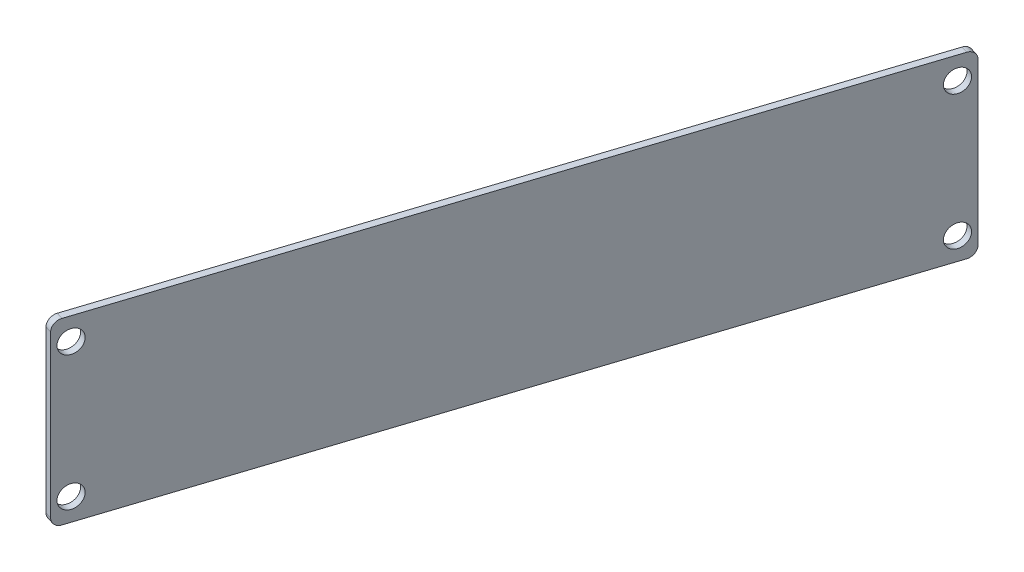
ISO-10303-21;
HEADER;
FILE_DESCRIPTION(('STEP AP214'),'2;1');
FILE_NAME('part.step','',(''),(''),'','','');
FILE_SCHEMA(('AUTOMOTIVE_DESIGN { 1 0 10303 214 1 1 1 1 }'));
ENDSEC;
DATA;
#1=APPLICATION_CONTEXT('core data for automotive mechanical design processes');
#2=APPLICATION_PROTOCOL_DEFINITION('international standard','automotive_design',2000,#1);
#3=PRODUCT_CONTEXT('',#1,'mechanical');
#4=PRODUCT('Part','Part','',(#3));
#5=PRODUCT_RELATED_PRODUCT_CATEGORY('part','',(#4));
#6=PRODUCT_DEFINITION_FORMATION('','',#4);
#7=PRODUCT_DEFINITION_CONTEXT('part definition',#1,'design');
#8=PRODUCT_DEFINITION('design','',#6,#7);
#9=PRODUCT_DEFINITION_SHAPE('','',#8);
#10=(LENGTH_UNIT() NAMED_UNIT(*) SI_UNIT(.MILLI.,.METRE.));
#11=(NAMED_UNIT(*) PLANE_ANGLE_UNIT() SI_UNIT($,.RADIAN.));
#12=(NAMED_UNIT(*) SI_UNIT($,.STERADIAN.) SOLID_ANGLE_UNIT());
#13=UNCERTAINTY_MEASURE_WITH_UNIT(LENGTH_MEASURE(1.E-05),#10,'distance_accuracy_value','');
#14=(GEOMETRIC_REPRESENTATION_CONTEXT(3) GLOBAL_UNCERTAINTY_ASSIGNED_CONTEXT((#13)) GLOBAL_UNIT_ASSIGNED_CONTEXT((#10,
#11,#12)) REPRESENTATION_CONTEXT('',''));
#15=CARTESIAN_POINT('',(0.,0.,0.));
#16=DIRECTION('',(0.,0.,1.));
#17=DIRECTION('',(1.,0.,0.));
#18=AXIS2_PLACEMENT_3D('',#15,#16,#17);
#19=CARTESIAN_POINT('',(-6.99958640490557,-1.43554837217458E-12,95.7236856182648));
#20=DIRECTION('',(0.,-1.,0.));
#21=DIRECTION('',(-0.309016994374967,0.,0.951056516295147));
#22=AXIS2_PLACEMENT_3D('',#19,#20,#21);
#23=PLANE('',#22);
#24=DIRECTION('',(-0.309016994374967,0.,0.951056516295147));
#25=VECTOR('',#24,1.);
#26=CARTESIAN_POINT('',(-6.99958640490557,-1.43554837217458E-12,95.7236856182648));
#27=LINE('',#26,#25);
#28=CARTESIAN_POINT('',(25.5307854164267,0.,-4.3945041944349));
#29=VERTEX_POINT('',#28);
#30=CARTESIAN_POINT('',(-24.0791085074902,-2.62772524152783E-12,148.289049616207));
#31=VERTEX_POINT('',#30);
#32=EDGE_CURVE('E107',#29,#31,#27,.T.);
#33=ORIENTED_EDGE('',*,*,#32,.F.);
#34=DIRECTION('',(-0.951056516295146,0.,-0.309016994374971));
#35=VECTOR('',#34,1.);
#36=CARTESIAN_POINT('',(27.0524758424989,0.,-3.90007700343494));
#37=LINE('',#36,#35);
#38=CARTESIAN_POINT('',(27.0524758424989,0.,-3.90007700343495));
#39=VERTEX_POINT('',#38);
#40=EDGE_CURVE('E203',#29,#39,#37,.F.);
#41=ORIENTED_EDGE('',*,*,#40,.T.);
#42=DIRECTION('',(-0.309016994374965,0.,0.951056516295147));
#43=VECTOR('',#42,1.);
#44=CARTESIAN_POINT('',(-13.2033208382077,-1.95825370560932E-12,119.994525716643));
#45=LINE('',#44,#43);
#46=CARTESIAN_POINT('',(-22.557418081418,-2.6289093810816E-12,148.783476807207));
#47=VERTEX_POINT('',#46);
#48=EDGE_CURVE('E219',#39,#47,#45,.T.);
#49=ORIENTED_EDGE('',*,*,#48,.T.);
#50=DIRECTION('',(-0.951056516295149,0.,-0.30901699437496));
#51=VECTOR('',#50,1.);
#52=CARTESIAN_POINT('',(-22.557418081418,-2.6289093810816E-12,148.783476807207));
#53=LINE('',#52,#51);
#54=EDGE_CURVE('E231',#47,#31,#53,.T.);
#55=ORIENTED_EDGE('',*,*,#54,.T.);
#56=EDGE_LOOP('',(#33,#41,#49,#55));
#57=FACE_BOUND('',#56,.T.);
#58=ADVANCED_FACE('F97',(#57),#23,.T.);
#59=CARTESIAN_POINT('',(-22.4504361236535,39.9999999999975,143.276511433021));
#60=DIRECTION('',(0.,1.,0.));
#61=DIRECTION('',(0.309016994374967,0.,-0.951056516295147));
#62=AXIS2_PLACEMENT_3D('',#59,#60,#61);
#63=PLANE('',#62);
#64=DIRECTION('',(-0.309016994374965,0.,0.951056516295147));
#65=VECTOR('',#64,1.);
#66=CARTESIAN_POINT('',(-13.2033208382074,39.999999999998,119.994525716644));
#67=LINE('',#66,#65);
#68=CARTESIAN_POINT('',(-22.5574180814182,39.9999999999974,148.783476807208));
#69=VERTEX_POINT('',#68);
#70=CARTESIAN_POINT('',(27.0524758424989,40.,-3.9000770034347));
#71=VERTEX_POINT('',#70);
#72=EDGE_CURVE('E101',#69,#71,#67,.F.);
#73=ORIENTED_EDGE('',*,*,#72,.T.);
#74=DIRECTION('',(-0.951056516295146,0.,-0.309016994374971));
#75=VECTOR('',#74,1.);
#76=CARTESIAN_POINT('',(27.0524758424989,40.,-3.90007700343469));
#77=LINE('',#76,#75);
#78=CARTESIAN_POINT('',(25.5307854164267,40.,-4.39450419443465));
#79=VERTEX_POINT('',#78);
#80=EDGE_CURVE('E182',#71,#79,#77,.T.);
#81=ORIENTED_EDGE('',*,*,#80,.T.);
#82=DIRECTION('',(0.309016994374967,0.,-0.951056516295147));
#83=VECTOR('',#82,1.);
#84=CARTESIAN_POINT('',(-22.4504361236535,39.9999999999975,143.276511433021));
#85=LINE('',#84,#83);
#86=CARTESIAN_POINT('',(-24.0791085074905,39.9999999999974,148.289049616208));
#87=VERTEX_POINT('',#86);
#88=EDGE_CURVE('E15',#87,#79,#85,.T.);
#89=ORIENTED_EDGE('',*,*,#88,.F.);
#90=DIRECTION('',(-0.951056516295149,0.,-0.30901699437496));
#91=VECTOR('',#90,1.);
#92=CARTESIAN_POINT('',(-22.5574180814182,39.9999999999974,148.783476807208));
#93=LINE('',#92,#91);
#94=EDGE_CURVE('E217',#87,#69,#93,.F.);
#95=ORIENTED_EDGE('',*,*,#94,.T.);
#96=EDGE_LOOP('',(#73,#81,#89,#95));
#97=FACE_BOUND('',#96,.T.);
#98=ADVANCED_FACE('F186',(#97),#63,.T.);
#99=CARTESIAN_POINT('',(18.090169943749,-1.16657485888249E-13,18.5053555522747));
#100=DIRECTION('',(-0.951056516295146,0.,-0.309016994374971));
#101=DIRECTION('',(-0.309016994374971,0.,0.951056516295146));
#102=AXIS2_PLACEMENT_3D('',#99,#100,#101);
#103=PLANE('',#102);
#104=ORIENTED_EDGE('',*,*,#32,.T.);
#105=CARTESIAN_POINT('',(-24.0791085074902,1.99999999999737,148.289049616207));
#106=DIRECTION('',(-0.951056516295149,0.,-0.30901699437496));
#107=DIRECTION('',(-0.30901699437496,0.,0.951056516295149));
#108=AXIS2_PLACEMENT_3D('',#105,#106,#107);
#109=CIRCLE('',#108,2.);
#110=CARTESIAN_POINT('',(-24.6971424962402,1.99999999999733,150.191162648797));
#111=VERTEX_POINT('',#110);
#112=EDGE_CURVE('E234',#31,#111,#109,.T.);
#113=ORIENTED_EDGE('',*,*,#112,.T.);
#114=DIRECTION('',(0.,1.,0.));
#115=VECTOR('',#114,1.);
#116=CARTESIAN_POINT('',(-24.6971424962402,-2.66808053422821E-12,150.191162648797));
#117=LINE('',#116,#115);
#118=CARTESIAN_POINT('',(-24.6971424962404,37.9999999999973,150.191162648798));
#119=VERTEX_POINT('',#118);
#120=EDGE_CURVE('E248',#119,#111,#117,.F.);
#121=ORIENTED_EDGE('',*,*,#120,.F.);
#122=CARTESIAN_POINT('',(-24.0791085074905,37.9999999999974,148.289049616208));
#123=DIRECTION('',(-0.951056516295149,0.,-0.30901699437496));
#124=DIRECTION('',(-0.30901699437496,0.,0.951056516295149));
#125=AXIS2_PLACEMENT_3D('',#122,#123,#124);
#126=CIRCLE('',#125,2.);
#127=EDGE_CURVE('E139',#119,#87,#126,.T.);
#128=ORIENTED_EDGE('',*,*,#127,.T.);
#129=ORIENTED_EDGE('',*,*,#88,.T.);
#130=CARTESIAN_POINT('',(25.5307854164267,38.,-4.39450419443466));
#131=DIRECTION('',(-0.951056516295146,0.,-0.309016994374971));
#132=DIRECTION('',(-0.309016994374971,0.,0.951056516295146));
#133=AXIS2_PLACEMENT_3D('',#130,#131,#132);
#134=CIRCLE('',#133,2.);
#135=CARTESIAN_POINT('',(26.1488194051766,38.,-6.29661722702495));
#136=VERTEX_POINT('',#135);
#137=EDGE_CURVE('E152',#79,#136,#134,.T.);
#138=ORIENTED_EDGE('',*,*,#137,.T.);
#139=DIRECTION('',(0.,-1.,0.));
#140=VECTOR('',#139,1.);
#141=CARTESIAN_POINT('',(26.1488194051766,40.,-6.29661722702493));
#142=LINE('',#141,#140);
#143=CARTESIAN_POINT('',(26.1488194051766,2.00000000000001,-6.29661722702517));
#144=VERTEX_POINT('',#143);
#145=EDGE_CURVE('E213',#144,#136,#142,.F.);
#146=ORIENTED_EDGE('',*,*,#145,.F.);
#147=CARTESIAN_POINT('',(25.5307854164267,2.,-4.39450419443488));
#148=DIRECTION('',(-0.951056516295146,0.,-0.309016994374971));
#149=DIRECTION('',(-0.309016994374971,0.,0.951056516295146));
#150=AXIS2_PLACEMENT_3D('',#147,#148,#149);
#151=CIRCLE('',#150,2.);
#152=EDGE_CURVE('E171',#144,#29,#151,.T.);
#153=ORIENTED_EDGE('',*,*,#152,.T.);
#154=EDGE_LOOP('',(#104,#113,#121,#128,#129,#138,#146,#153));
#155=FACE_BOUND('',#154,.T.);
#156=CARTESIAN_POINT('',(-23.573789309947,4.99999999999742,146.73383704091));
#157=DIRECTION('',(-0.951056516295149,0.,-0.30901699437496));
#158=DIRECTION('',(-0.30901699437496,0.,0.951056516295149));
#159=AXIS2_PLACEMENT_3D('',#156,#157,#158);
#160=CIRCLE('',#159,2.5);
#161=CARTESIAN_POINT('',(-24.3463317958844,4.99999999999737,149.111478331648));
#162=VERTEX_POINT('',#161);
#163=EDGE_CURVE('E240',#162,#162,#160,.T.);
#164=ORIENTED_EDGE('',*,*,#163,.F.);
#165=EDGE_LOOP('',(#164));
#166=FACE_BOUND('',#165,.T.);
#167=CARTESIAN_POINT('',(-23.5737893099472,34.9999999999974,146.73383704091));
#168=DIRECTION('',(-0.951056516295149,0.,-0.30901699437496));
#169=DIRECTION('',(-0.30901699437496,0.,0.951056516295149));
#170=AXIS2_PLACEMENT_3D('',#167,#168,#169);
#171=CIRCLE('',#170,2.5);
#172=CARTESIAN_POINT('',(-24.3463317958846,34.9999999999974,149.111478331648));
#173=VERTEX_POINT('',#172);
#174=EDGE_CURVE('E237',#173,#173,#171,.F.);
#175=ORIENTED_EDGE('',*,*,#174,.T.);
#176=EDGE_LOOP('',(#175));
#177=FACE_BOUND('',#176,.T.);
#178=CARTESIAN_POINT('',(25.0254662188834,4.99999999999997,-2.83929161913737));
#179=DIRECTION('',(-0.951056516295146,0.,-0.309016994374971));
#180=DIRECTION('',(-0.309016994374971,0.,0.951056516295146));
#181=AXIS2_PLACEMENT_3D('',#178,#179,#180);
#182=CIRCLE('',#181,2.5);
#183=CARTESIAN_POINT('',(24.252923732946,4.99999999999997,-0.461650328399509));
#184=VERTEX_POINT('',#183);
#185=EDGE_CURVE('E206',#184,#184,#182,.T.);
#186=ORIENTED_EDGE('',*,*,#185,.F.);
#187=EDGE_LOOP('',(#186));
#188=FACE_BOUND('',#187,.T.);
#189=CARTESIAN_POINT('',(25.0254662188834,35.,-2.83929161913735));
#190=DIRECTION('',(-0.951056516295146,0.,-0.309016994374971));
#191=DIRECTION('',(-0.309016994374971,0.,0.951056516295146));
#192=AXIS2_PLACEMENT_3D('',#189,#190,#191);
#193=CIRCLE('',#192,2.5);
#194=CARTESIAN_POINT('',(24.252923732946,35.,-0.461650328399488));
#195=VERTEX_POINT('',#194);
#196=EDGE_CURVE('E187',#195,#195,#193,.F.);
#197=ORIENTED_EDGE('',*,*,#196,.T.);
#198=EDGE_LOOP('',(#197));
#199=FACE_BOUND('',#198,.T.);
#200=ADVANCED_FACE('F99',(#155,#166,#177,#188,#199),#103,.T.);
#201=CARTESIAN_POINT('',(-13.2033208382075,19.999999999998,119.994525716644));
#202=DIRECTION('',(-0.951056516295147,0.,-0.309016994374965));
#203=DIRECTION('',(-0.309016994374965,0.,0.951056516295147));
#204=AXIS2_PLACEMENT_3D('',#201,#202,#203);
#205=PLANE('',#204);
#206=ORIENTED_EDGE('',*,*,#72,.F.);
#207=CARTESIAN_POINT('',(-22.5574180814182,37.9999999999974,148.783476807208));
#208=DIRECTION('',(-0.951056516295149,0.,-0.30901699437496));
#209=DIRECTION('',(-0.30901699437496,0.,0.951056516295149));
#210=AXIS2_PLACEMENT_3D('',#207,#208,#209);
#211=CIRCLE('',#210,2.);
#212=CARTESIAN_POINT('',(-23.1754520701681,37.9999999999973,150.685589839798));
#213=VERTEX_POINT('',#212);
#214=EDGE_CURVE('E226',#69,#213,#211,.F.);
#215=ORIENTED_EDGE('',*,*,#214,.T.);
#216=DIRECTION('',(0.,-1.,0.));
#217=VECTOR('',#216,1.);
#218=CARTESIAN_POINT('',(-23.1754520701679,-2.64261535141601E-12,150.685589839797));
#219=LINE('',#218,#217);
#220=CARTESIAN_POINT('',(-23.1754520701679,1.99999999999733,150.685589839797));
#221=VERTEX_POINT('',#220);
#222=EDGE_CURVE('E223',#213,#221,#219,.T.);
#223=ORIENTED_EDGE('',*,*,#222,.T.);
#224=CARTESIAN_POINT('',(-22.557418081418,1.99999999999737,148.783476807207));
#225=DIRECTION('',(-0.951056516295149,0.,-0.30901699437496));
#226=DIRECTION('',(-0.30901699437496,0.,0.951056516295149));
#227=AXIS2_PLACEMENT_3D('',#224,#225,#226);
#228=CIRCLE('',#227,2.);
#229=EDGE_CURVE('E220',#221,#47,#228,.F.);
#230=ORIENTED_EDGE('',*,*,#229,.T.);
#231=ORIENTED_EDGE('',*,*,#48,.F.);
#232=CARTESIAN_POINT('',(27.0524758424989,2.,-3.90007700343493));
#233=DIRECTION('',(-0.951056516295146,0.,-0.309016994374971));
#234=DIRECTION('',(-0.309016994374971,0.,0.951056516295146));
#235=AXIS2_PLACEMENT_3D('',#232,#233,#234);
#236=CIRCLE('',#235,2.);
#237=CARTESIAN_POINT('',(27.6705098312489,2.00000000000001,-5.80219003602522));
#238=VERTEX_POINT('',#237);
#239=EDGE_CURVE('E198',#39,#238,#236,.F.);
#240=ORIENTED_EDGE('',*,*,#239,.T.);
#241=DIRECTION('',(0.,1.,0.));
#242=VECTOR('',#241,1.);
#243=CARTESIAN_POINT('',(27.6705098312489,0.,-5.80219003602523));
#244=LINE('',#243,#242);
#245=CARTESIAN_POINT('',(27.6705098312489,38.,-5.802190036025));
#246=VERTEX_POINT('',#245);
#247=EDGE_CURVE('E192',#238,#246,#244,.T.);
#248=ORIENTED_EDGE('',*,*,#247,.T.);
#249=CARTESIAN_POINT('',(27.0524758424989,38.,-3.9000770034347));
#250=DIRECTION('',(-0.951056516295146,0.,-0.309016994374971));
#251=DIRECTION('',(-0.309016994374971,0.,0.951056516295146));
#252=AXIS2_PLACEMENT_3D('',#249,#250,#251);
#253=CIRCLE('',#252,2.);
#254=EDGE_CURVE('E188',#246,#71,#253,.F.);
#255=ORIENTED_EDGE('',*,*,#254,.T.);
#256=EDGE_LOOP('',(#206,#215,#223,#230,#231,#240,#248,#255));
#257=FACE_BOUND('',#256,.T.);
#258=CARTESIAN_POINT('',(-22.0520988838748,4.99999999999742,147.22826423191));
#259=DIRECTION('',(-0.951056516295149,0.,-0.30901699437496));
#260=DIRECTION('',(0.30901699437496,0.,-0.951056516295149));
#261=AXIS2_PLACEMENT_3D('',#258,#259,#260);
#262=CIRCLE('',#261,2.5);
#263=CARTESIAN_POINT('',(-21.2795563979374,4.99999999999747,144.850622941172));
#264=VERTEX_POINT('',#263);
#265=EDGE_CURVE('E228',#264,#264,#262,.T.);
#266=ORIENTED_EDGE('',*,*,#265,.T.);
#267=EDGE_LOOP('',(#266));
#268=FACE_BOUND('',#267,.T.);
#269=CARTESIAN_POINT('',(-22.052098883875,34.9999999999974,147.22826423191));
#270=DIRECTION('',(0.951056516295149,0.,0.30901699437496));
#271=DIRECTION('',(0.30901699437496,0.,-0.951056516295149));
#272=AXIS2_PLACEMENT_3D('',#269,#270,#271);
#273=CIRCLE('',#272,2.5);
#274=CARTESIAN_POINT('',(-21.2795563979376,34.9999999999975,144.850622941172));
#275=VERTEX_POINT('',#274);
#276=EDGE_CURVE('E243',#275,#275,#273,.T.);
#277=ORIENTED_EDGE('',*,*,#276,.F.);
#278=EDGE_LOOP('',(#277));
#279=FACE_BOUND('',#278,.T.);
#280=CARTESIAN_POINT('',(26.5471566449556,4.99999999999997,-2.34486442813742));
#281=DIRECTION('',(-0.951056516295147,0.,-0.309016994374969));
#282=DIRECTION('',(0.309016994374969,0.,-0.951056516295147));
#283=AXIS2_PLACEMENT_3D('',#280,#281,#282);
#284=CIRCLE('',#283,2.5);
#285=CARTESIAN_POINT('',(27.319699130893,4.99999999999997,-4.72250571887529));
#286=VERTEX_POINT('',#285);
#287=EDGE_CURVE('E200',#286,#286,#284,.T.);
#288=ORIENTED_EDGE('',*,*,#287,.T.);
#289=EDGE_LOOP('',(#288));
#290=FACE_BOUND('',#289,.T.);
#291=CARTESIAN_POINT('',(26.5471566449556,35.,-2.34486442813742));
#292=DIRECTION('',(0.951056516295147,0.,0.309016994374969));
#293=DIRECTION('',(0.309016994374969,0.,-0.951056516295147));
#294=AXIS2_PLACEMENT_3D('',#291,#292,#293);
#295=CIRCLE('',#294,2.5);
#296=CARTESIAN_POINT('',(27.319699130893,35.,-4.72250571887529));
#297=VERTEX_POINT('',#296);
#298=EDGE_CURVE('E209',#297,#297,#295,.T.);
#299=ORIENTED_EDGE('',*,*,#298,.F.);
#300=EDGE_LOOP('',(#299));
#301=FACE_BOUND('',#300,.T.);
#302=ADVANCED_FACE('F256',(#257,#268,#279,#290,#301),#205,.F.);
#303=CARTESIAN_POINT('',(-22.557418081418,1.99999999999737,148.783476807207));
#304=DIRECTION('',(-0.951056516295149,0.,-0.30901699437496));
#305=DIRECTION('',(-0.30901699437496,0.,0.951056516295149));
#306=AXIS2_PLACEMENT_3D('',#303,#304,#305);
#307=CYLINDRICAL_SURFACE('',#306,2.);
#308=ORIENTED_EDGE('',*,*,#229,.F.);
#309=DIRECTION('',(-0.951056516295149,0.,-0.30901699437496));
#310=VECTOR('',#309,1.);
#311=CARTESIAN_POINT('',(-23.1754520701679,1.99999999999733,150.685589839797));
#312=LINE('',#311,#310);
#313=EDGE_CURVE('E246',#111,#221,#312,.F.);
#314=ORIENTED_EDGE('',*,*,#313,.F.);
#315=ORIENTED_EDGE('',*,*,#112,.F.);
#316=ORIENTED_EDGE('',*,*,#54,.F.);
#317=EDGE_LOOP('',(#308,#314,#315,#316));
#318=FACE_BOUND('',#317,.T.);
#319=ADVANCED_FACE('F261',(#318),#307,.T.);
#320=CARTESIAN_POINT('',(-22.5574180814182,37.9999999999974,148.783476807208));
#321=DIRECTION('',(-0.951056516295149,0.,-0.30901699437496));
#322=DIRECTION('',(-0.30901699437496,0.,0.951056516295149));
#323=AXIS2_PLACEMENT_3D('',#320,#321,#322);
#324=CYLINDRICAL_SURFACE('',#323,2.);
#325=ORIENTED_EDGE('',*,*,#214,.F.);
#326=ORIENTED_EDGE('',*,*,#94,.F.);
#327=ORIENTED_EDGE('',*,*,#127,.F.);
#328=DIRECTION('',(-0.951056516295149,0.,-0.30901699437496));
#329=VECTOR('',#328,1.);
#330=CARTESIAN_POINT('',(-23.1754520701681,37.9999999999973,150.685589839798));
#331=LINE('',#330,#329);
#332=EDGE_CURVE('E184',#213,#119,#331,.T.);
#333=ORIENTED_EDGE('',*,*,#332,.F.);
#334=EDGE_LOOP('',(#325,#326,#327,#333));
#335=FACE_BOUND('',#334,.T.);
#336=ADVANCED_FACE('F265',(#335),#324,.T.);
#337=CARTESIAN_POINT('',(-23.1754520701679,-2.66926467378198E-12,150.685589839797));
#338=DIRECTION('',(0.30901699437496,0.,-0.951056516295149));
#339=DIRECTION('',(-0.951056516295149,0.,-0.30901699437496));
#340=AXIS2_PLACEMENT_3D('',#337,#338,#339);
#341=PLANE('',#340);
#342=ORIENTED_EDGE('',*,*,#222,.F.);
#343=ORIENTED_EDGE('',*,*,#332,.T.);
#344=ORIENTED_EDGE('',*,*,#120,.T.);
#345=ORIENTED_EDGE('',*,*,#313,.T.);
#346=EDGE_LOOP('',(#342,#343,#344,#345));
#347=FACE_BOUND('',#346,.T.);
#348=ADVANCED_FACE('F263',(#347),#341,.F.);
#349=CARTESIAN_POINT('',(-67.9364056489298,34.9999999999975,132.319549215951));
#350=DIRECTION('',(0.951056516295149,0.,0.30901699437496));
#351=DIRECTION('',(0.30901699437496,0.,-0.951056516295149));
#352=AXIS2_PLACEMENT_3D('',#349,#350,#351);
#353=CYLINDRICAL_SURFACE('',#352,2.5);
#354=ORIENTED_EDGE('',*,*,#174,.F.);
#355=EDGE_LOOP('',(#354));
#356=FACE_BOUND('',#355,.T.);
#357=ORIENTED_EDGE('',*,*,#276,.T.);
#358=EDGE_LOOP('',(#357));
#359=FACE_BOUND('',#358,.T.);
#360=ADVANCED_FACE('F272',(#356,#359),#353,.F.);
#361=CARTESIAN_POINT('',(-67.9364056489296,4.99999999999745,132.31954921595));
#362=DIRECTION('',(0.951056516295149,0.,0.30901699437496));
#363=DIRECTION('',(0.30901699437496,0.,-0.951056516295149));
#364=AXIS2_PLACEMENT_3D('',#361,#362,#363);
#365=CYLINDRICAL_SURFACE('',#364,2.5);
#366=ORIENTED_EDGE('',*,*,#163,.T.);
#367=EDGE_LOOP('',(#366));
#368=FACE_BOUND('',#367,.T.);
#369=ORIENTED_EDGE('',*,*,#265,.F.);
#370=EDGE_LOOP('',(#369));
#371=FACE_BOUND('',#370,.T.);
#372=ADVANCED_FACE('F284',(#368,#371),#365,.F.);
#373=CARTESIAN_POINT('',(27.0524758424989,38.,-3.90007700343471));
#374=DIRECTION('',(-0.951056516295146,0.,-0.309016994374971));
#375=DIRECTION('',(-0.309016994374971,0.,0.951056516295146));
#376=AXIS2_PLACEMENT_3D('',#373,#374,#375);
#377=CYLINDRICAL_SURFACE('',#376,2.);
#378=ORIENTED_EDGE('',*,*,#254,.F.);
#379=DIRECTION('',(-0.951056516295146,0.,-0.309016994374971));
#380=VECTOR('',#379,1.);
#381=CARTESIAN_POINT('',(27.6705098312489,38.,-5.80219003602499));
#382=LINE('',#381,#380);
#383=EDGE_CURVE('E183',#136,#246,#382,.F.);
#384=ORIENTED_EDGE('',*,*,#383,.F.);
#385=ORIENTED_EDGE('',*,*,#137,.F.);
#386=ORIENTED_EDGE('',*,*,#80,.F.);
#387=EDGE_LOOP('',(#378,#384,#385,#386));
#388=FACE_BOUND('',#387,.T.);
#389=ADVANCED_FACE('F181',(#388),#377,.T.);
#390=CARTESIAN_POINT('',(27.0524758424989,2.,-3.90007700343493));
#391=DIRECTION('',(-0.951056516295146,0.,-0.309016994374971));
#392=DIRECTION('',(-0.309016994374971,0.,0.951056516295146));
#393=AXIS2_PLACEMENT_3D('',#390,#391,#392);
#394=CYLINDRICAL_SURFACE('',#393,2.);
#395=ORIENTED_EDGE('',*,*,#239,.F.);
#396=ORIENTED_EDGE('',*,*,#40,.F.);
#397=ORIENTED_EDGE('',*,*,#152,.F.);
#398=DIRECTION('',(-0.951056516295146,0.,-0.309016994374971));
#399=VECTOR('',#398,1.);
#400=CARTESIAN_POINT('',(27.6705098312489,2.00000000000001,-5.80219003602522));
#401=LINE('',#400,#399);
#402=EDGE_CURVE('E215',#238,#144,#401,.T.);
#403=ORIENTED_EDGE('',*,*,#402,.F.);
#404=EDGE_LOOP('',(#395,#396,#397,#403));
#405=FACE_BOUND('',#404,.T.);
#406=ADVANCED_FACE('F313',(#405),#394,.T.);
#407=CARTESIAN_POINT('',(27.6705098312489,40.,-5.80219003602498));
#408=DIRECTION('',(-0.309016994374971,0.,0.951056516295146));
#409=DIRECTION('',(0.951056516295146,0.,0.309016994374971));
#410=AXIS2_PLACEMENT_3D('',#407,#408,#409);
#411=PLANE('',#410);
#412=ORIENTED_EDGE('',*,*,#247,.F.);
#413=ORIENTED_EDGE('',*,*,#402,.T.);
#414=ORIENTED_EDGE('',*,*,#145,.T.);
#415=ORIENTED_EDGE('',*,*,#383,.T.);
#416=EDGE_LOOP('',(#412,#413,#414,#415));
#417=FACE_BOUND('',#416,.T.);
#418=ADVANCED_FACE('F304',(#417),#411,.F.);
#419=CARTESIAN_POINT('',(-20.7450546196287,35.0000000000001,-17.7110353464098));
#420=DIRECTION('',(0.951056516295147,0.,0.309016994374969));
#421=DIRECTION('',(0.309016994374969,0.,-0.951056516295147));
#422=AXIS2_PLACEMENT_3D('',#419,#420,#421);
#423=CYLINDRICAL_SURFACE('',#422,2.5);
#424=ORIENTED_EDGE('',*,*,#196,.F.);
#425=EDGE_LOOP('',(#424));
#426=FACE_BOUND('',#425,.T.);
#427=ORIENTED_EDGE('',*,*,#298,.T.);
#428=EDGE_LOOP('',(#427));
#429=FACE_BOUND('',#428,.T.);
#430=ADVANCED_FACE('F301',(#426,#429),#423,.F.);
#431=CARTESIAN_POINT('',(-20.7450546196287,4.9999999999999,-17.7110353464098));
#432=DIRECTION('',(0.951056516295147,0.,0.309016994374969));
#433=DIRECTION('',(0.309016994374969,0.,-0.951056516295147));
#434=AXIS2_PLACEMENT_3D('',#431,#432,#433);
#435=CYLINDRICAL_SURFACE('',#434,2.5);
#436=ORIENTED_EDGE('',*,*,#185,.T.);
#437=EDGE_LOOP('',(#436));
#438=FACE_BOUND('',#437,.T.);
#439=ORIENTED_EDGE('',*,*,#287,.F.);
#440=EDGE_LOOP('',(#439));
#441=FACE_BOUND('',#440,.T.);
#442=ADVANCED_FACE('F303',(#438,#441),#435,.F.);
#443=CLOSED_SHELL('',(#58,#98,#200,#302,#319,#336,#348,#360,#372,#389,#406,#418,#430,#442));
#444=MANIFOLD_SOLID_BREP('B2',#443);
#445=ADVANCED_BREP_SHAPE_REPRESENTATION('',(#18,#444),#14);
#446=SHAPE_DEFINITION_REPRESENTATION(#9,#445);
ENDSEC;
END-ISO-10303-21;
